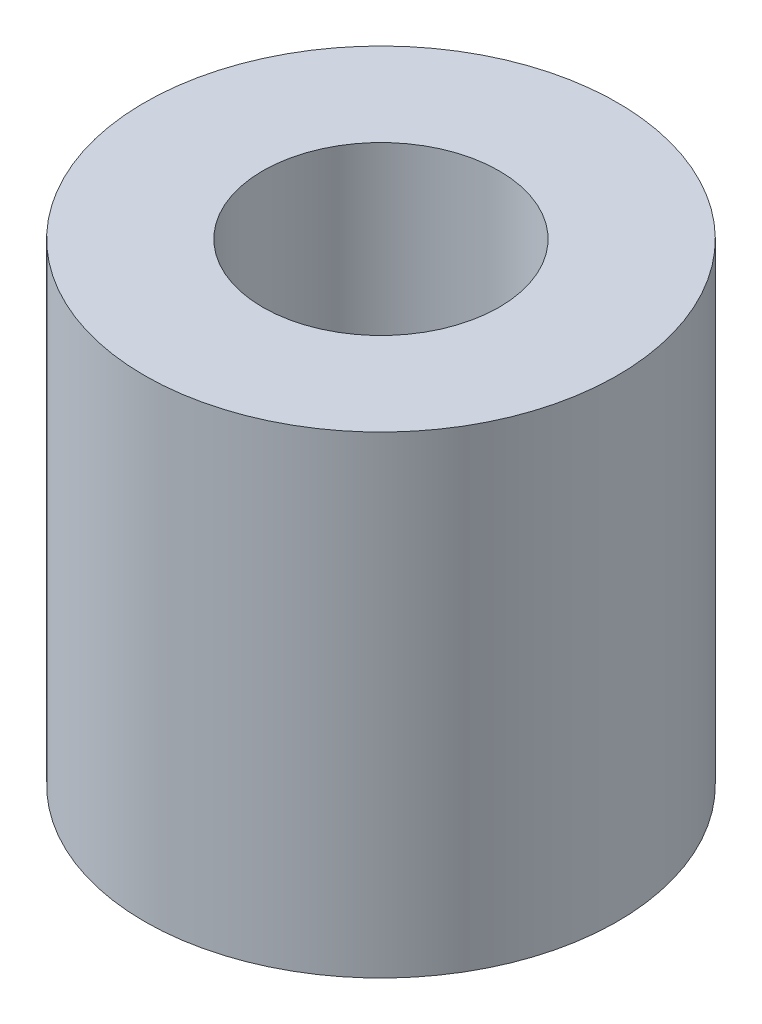
ISO-10303-21;
HEADER;
FILE_DESCRIPTION(('STEP AP214'),'2;1');
FILE_NAME('part.step','',(''),(''),'','','');
FILE_SCHEMA(('AUTOMOTIVE_DESIGN { 1 0 10303 214 1 1 1 1 }'));
ENDSEC;
DATA;
#1=APPLICATION_CONTEXT('core data for automotive mechanical design processes');
#2=APPLICATION_PROTOCOL_DEFINITION('international standard','automotive_design',2000,#1);
#3=PRODUCT_CONTEXT('',#1,'mechanical');
#4=PRODUCT('Part','Part','',(#3));
#5=PRODUCT_RELATED_PRODUCT_CATEGORY('part','',(#4));
#6=PRODUCT_DEFINITION_FORMATION('','',#4);
#7=PRODUCT_DEFINITION_CONTEXT('part definition',#1,'design');
#8=PRODUCT_DEFINITION('design','',#6,#7);
#9=PRODUCT_DEFINITION_SHAPE('','',#8);
#10=(LENGTH_UNIT() NAMED_UNIT(*) SI_UNIT(.MILLI.,.METRE.));
#11=(NAMED_UNIT(*) PLANE_ANGLE_UNIT() SI_UNIT($,.RADIAN.));
#12=(NAMED_UNIT(*) SI_UNIT($,.STERADIAN.) SOLID_ANGLE_UNIT());
#13=UNCERTAINTY_MEASURE_WITH_UNIT(LENGTH_MEASURE(1.E-05),#10,'distance_accuracy_value','');
#14=(GEOMETRIC_REPRESENTATION_CONTEXT(3) GLOBAL_UNCERTAINTY_ASSIGNED_CONTEXT((#13)) GLOBAL_UNIT_ASSIGNED_CONTEXT((#10,
#11,#12)) REPRESENTATION_CONTEXT('',''));
#15=CARTESIAN_POINT('',(0.,0.,0.));
#16=DIRECTION('',(0.,0.,1.));
#17=DIRECTION('',(1.,0.,0.));
#18=AXIS2_PLACEMENT_3D('',#15,#16,#17);
#19=CARTESIAN_POINT('',(0.,12.7,0.));
#20=DIRECTION('',(0.,1.,0.));
#21=DIRECTION('',(0.,0.,1.));
#22=AXIS2_PLACEMENT_3D('',#19,#20,#21);
#23=PLANE('',#22);
#24=CARTESIAN_POINT('',(0.,12.7,0.));
#25=DIRECTION('',(0.,1.,0.));
#26=DIRECTION('',(0.,0.,1.));
#27=AXIS2_PLACEMENT_3D('',#24,#25,#26);
#28=CIRCLE('',#27,6.35);
#29=CARTESIAN_POINT('',(0.,12.7,6.35));
#30=VERTEX_POINT('',#29);
#31=EDGE_CURVE('E10',#30,#30,#28,.T.);
#32=ORIENTED_EDGE('',*,*,#31,.T.);
#33=EDGE_LOOP('',(#32));
#34=FACE_BOUND('',#33,.T.);
#35=CARTESIAN_POINT('',(0.,12.7,0.));
#36=DIRECTION('',(0.,1.,0.));
#37=DIRECTION('',(0.,0.,1.));
#38=AXIS2_PLACEMENT_3D('',#35,#36,#37);
#39=CIRCLE('',#38,3.175);
#40=CARTESIAN_POINT('',(0.,12.7,3.175));
#41=VERTEX_POINT('',#40);
#42=EDGE_CURVE('E44',#41,#41,#39,.T.);
#43=ORIENTED_EDGE('',*,*,#42,.F.);
#44=EDGE_LOOP('',(#43));
#45=FACE_BOUND('',#44,.T.);
#46=ADVANCED_FACE('F33',(#34,#45),#23,.T.);
#47=CARTESIAN_POINT('',(0.,0.,0.));
#48=DIRECTION('',(0.,1.,0.));
#49=DIRECTION('',(0.,0.,1.));
#50=AXIS2_PLACEMENT_3D('',#47,#48,#49);
#51=PLANE('',#50);
#52=CARTESIAN_POINT('',(0.,0.,0.));
#53=DIRECTION('',(0.,1.,0.));
#54=DIRECTION('',(0.,0.,1.));
#55=AXIS2_PLACEMENT_3D('',#52,#53,#54);
#56=CIRCLE('',#55,6.35);
#57=CARTESIAN_POINT('',(0.,0.,6.35));
#58=VERTEX_POINT('',#57);
#59=EDGE_CURVE('E37',#58,#58,#56,.T.);
#60=ORIENTED_EDGE('',*,*,#59,.F.);
#61=EDGE_LOOP('',(#60));
#62=FACE_BOUND('',#61,.T.);
#63=CARTESIAN_POINT('',(0.,0.,0.));
#64=DIRECTION('',(0.,1.,0.));
#65=DIRECTION('',(0.,0.,1.));
#66=AXIS2_PLACEMENT_3D('',#63,#64,#65);
#67=CIRCLE('',#66,3.175);
#68=CARTESIAN_POINT('',(0.,0.,3.175));
#69=VERTEX_POINT('',#68);
#70=EDGE_CURVE('E46',#69,#69,#67,.T.);
#71=ORIENTED_EDGE('',*,*,#70,.T.);
#72=EDGE_LOOP('',(#71));
#73=FACE_BOUND('',#72,.T.);
#74=ADVANCED_FACE('F56',(#62,#73),#51,.F.);
#75=CARTESIAN_POINT('',(0.,12.7,0.));
#76=DIRECTION('',(0.,-1.,0.));
#77=DIRECTION('',(0.,0.,-1.));
#78=AXIS2_PLACEMENT_3D('',#75,#76,#77);
#79=CYLINDRICAL_SURFACE('',#78,6.35);
#80=ORIENTED_EDGE('',*,*,#31,.F.);
#81=EDGE_LOOP('',(#80));
#82=FACE_BOUND('',#81,.T.);
#83=ORIENTED_EDGE('',*,*,#59,.T.);
#84=EDGE_LOOP('',(#83));
#85=FACE_BOUND('',#84,.T.);
#86=ADVANCED_FACE('F35',(#82,#85),#79,.T.);
#87=CARTESIAN_POINT('',(0.,12.7,0.));
#88=DIRECTION('',(0.,-1.,0.));
#89=DIRECTION('',(0.,0.,-1.));
#90=AXIS2_PLACEMENT_3D('',#87,#88,#89);
#91=CYLINDRICAL_SURFACE('',#90,3.175);
#92=ORIENTED_EDGE('',*,*,#42,.T.);
#93=EDGE_LOOP('',(#92));
#94=FACE_BOUND('',#93,.T.);
#95=ORIENTED_EDGE('',*,*,#70,.F.);
#96=EDGE_LOOP('',(#95));
#97=FACE_BOUND('',#96,.T.);
#98=ADVANCED_FACE('F52',(#94,#97),#91,.F.);
#99=CLOSED_SHELL('',(#46,#74,#86,#98));
#100=MANIFOLD_SOLID_BREP('B2',#99);
#101=ADVANCED_BREP_SHAPE_REPRESENTATION('',(#18,#100),#14);
#102=SHAPE_DEFINITION_REPRESENTATION(#9,#101);
ENDSEC;
END-ISO-10303-21;
